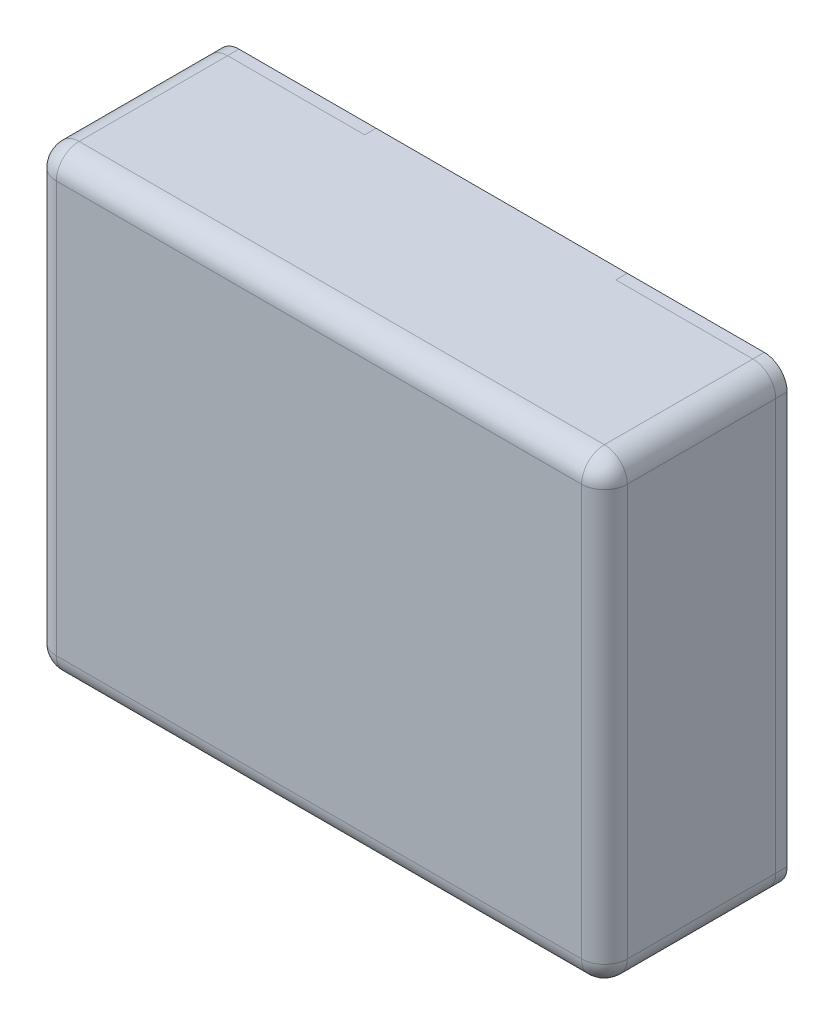
ISO-10303-21;
HEADER;
FILE_DESCRIPTION(('STEP AP214'),'2;1');
FILE_NAME('part.step','',(''),(''),'','','');
FILE_SCHEMA(('AUTOMOTIVE_DESIGN { 1 0 10303 214 1 1 1 1 }'));
ENDSEC;
DATA;
#1=APPLICATION_CONTEXT('core data for automotive mechanical design processes');
#2=APPLICATION_PROTOCOL_DEFINITION('international standard','automotive_design',2000,#1);
#3=PRODUCT_CONTEXT('',#1,'mechanical');
#4=PRODUCT('Part','Part','',(#3));
#5=PRODUCT_RELATED_PRODUCT_CATEGORY('part','',(#4));
#6=PRODUCT_DEFINITION_FORMATION('','',#4);
#7=PRODUCT_DEFINITION_CONTEXT('part definition',#1,'design');
#8=PRODUCT_DEFINITION('design','',#6,#7);
#9=PRODUCT_DEFINITION_SHAPE('','',#8);
#10=(LENGTH_UNIT() NAMED_UNIT(*) SI_UNIT(.MILLI.,.METRE.));
#11=(NAMED_UNIT(*) PLANE_ANGLE_UNIT() SI_UNIT($,.RADIAN.));
#12=(NAMED_UNIT(*) SI_UNIT($,.STERADIAN.) SOLID_ANGLE_UNIT());
#13=UNCERTAINTY_MEASURE_WITH_UNIT(LENGTH_MEASURE(1.E-05),#10,'distance_accuracy_value','');
#14=(GEOMETRIC_REPRESENTATION_CONTEXT(3) GLOBAL_UNCERTAINTY_ASSIGNED_CONTEXT((#13)) GLOBAL_UNIT_ASSIGNED_CONTEXT((#10,
#11,#12)) REPRESENTATION_CONTEXT('',''));
#15=CARTESIAN_POINT('',(0.,0.,0.));
#16=DIRECTION('',(0.,0.,1.));
#17=DIRECTION('',(1.,0.,0.));
#18=AXIS2_PLACEMENT_3D('',#15,#16,#17);
#19=CARTESIAN_POINT('',(1.15,0.9,0.));
#20=DIRECTION('',(0.,0.,1.));
#21=DIRECTION('',(1.,0.,0.));
#22=AXIS2_PLACEMENT_3D('',#19,#20,#21);
#23=CYLINDRICAL_SURFACE('',#22,0.1);
#24=CARTESIAN_POINT('',(1.15,0.9,0.));
#25=DIRECTION('',(0.,0.,1.));
#26=DIRECTION('',(0.,-1.,0.));
#27=AXIS2_PLACEMENT_3D('',#24,#25,#26);
#28=CIRCLE('',#27,0.1);
#29=CARTESIAN_POINT('',(1.25,0.9,0.));
#30=VERTEX_POINT('',#29);
#31=CARTESIAN_POINT('',(1.15,1.,0.));
#32=VERTEX_POINT('',#31);
#33=EDGE_CURVE('E11',#30,#32,#28,.T.);
#34=ORIENTED_EDGE('',*,*,#33,.T.);
#35=DIRECTION('',(0.,0.,1.));
#36=VECTOR('',#35,1.);
#37=CARTESIAN_POINT('',(1.15,1.,0.));
#38=LINE('',#37,#36);
#39=CARTESIAN_POINT('',(1.15,1.,0.05));
#40=VERTEX_POINT('',#39);
#41=EDGE_CURVE('E204',#32,#40,#38,.T.);
#42=ORIENTED_EDGE('',*,*,#41,.T.);
#43=CARTESIAN_POINT('',(1.15,0.9,0.05));
#44=DIRECTION('',(0.,0.,1.));
#45=DIRECTION('',(0.,-1.,0.));
#46=AXIS2_PLACEMENT_3D('',#43,#44,#45);
#47=CIRCLE('',#46,0.1);
#48=CARTESIAN_POINT('',(1.25,0.9,0.05));
#49=VERTEX_POINT('',#48);
#50=EDGE_CURVE('E201',#49,#40,#47,.T.);
#51=ORIENTED_EDGE('',*,*,#50,.F.);
#52=DIRECTION('',(0.,0.,1.));
#53=VECTOR('',#52,1.);
#54=CARTESIAN_POINT('',(1.25,0.9,0.));
#55=LINE('',#54,#53);
#56=EDGE_CURVE('E20',#30,#49,#55,.T.);
#57=ORIENTED_EDGE('',*,*,#56,.F.);
#58=EDGE_LOOP('',(#34,#42,#51,#57));
#59=FACE_BOUND('',#58,.T.);
#60=ADVANCED_FACE('F16',(#59),#23,.T.);
#61=CARTESIAN_POINT('',(0.55,-1.,0.));
#62=DIRECTION('',(0.,0.,1.));
#63=DIRECTION('',(1.,0.,0.));
#64=AXIS2_PLACEMENT_3D('',#61,#62,#63);
#65=PLANE('',#64);
#66=ORIENTED_EDGE('',*,*,#33,.F.);
#67=DIRECTION('',(0.,1.,0.));
#68=VECTOR('',#67,1.);
#69=CARTESIAN_POINT('',(1.25,-1.,0.));
#70=LINE('',#69,#68);
#71=CARTESIAN_POINT('',(1.25,-0.9,0.));
#72=VERTEX_POINT('',#71);
#73=EDGE_CURVE('E197',#72,#30,#70,.T.);
#74=ORIENTED_EDGE('',*,*,#73,.F.);
#75=CARTESIAN_POINT('',(1.15,-0.9,0.));
#76=DIRECTION('',(0.,0.,-1.));
#77=DIRECTION('',(0.,-1.,0.));
#78=AXIS2_PLACEMENT_3D('',#75,#76,#77);
#79=CIRCLE('',#78,0.1);
#80=CARTESIAN_POINT('',(1.15,-1.,0.));
#81=VERTEX_POINT('',#80);
#82=EDGE_CURVE('E27',#72,#81,#79,.T.);
#83=ORIENTED_EDGE('',*,*,#82,.T.);
#84=DIRECTION('',(1.,0.,0.));
#85=VECTOR('',#84,1.);
#86=CARTESIAN_POINT('',(0.55,-1.,0.));
#87=LINE('',#86,#85);
#88=CARTESIAN_POINT('',(0.55,-1.,0.));
#89=VERTEX_POINT('',#88);
#90=EDGE_CURVE('E209',#89,#81,#87,.T.);
#91=ORIENTED_EDGE('',*,*,#90,.F.);
#92=DIRECTION('',(0.,1.,0.));
#93=VECTOR('',#92,1.);
#94=CARTESIAN_POINT('',(0.55,-1.,0.));
#95=LINE('',#94,#93);
#96=CARTESIAN_POINT('',(0.55,1.,0.));
#97=VERTEX_POINT('',#96);
#98=EDGE_CURVE('E272',#89,#97,#95,.T.);
#99=ORIENTED_EDGE('',*,*,#98,.T.);
#100=DIRECTION('',(1.,0.,0.));
#101=VECTOR('',#100,1.);
#102=CARTESIAN_POINT('',(0.55,1.,0.));
#103=LINE('',#102,#101);
#104=EDGE_CURVE('E208',#97,#32,#103,.T.);
#105=ORIENTED_EDGE('',*,*,#104,.T.);
#106=EDGE_LOOP('',(#66,#74,#83,#91,#99,#105));
#107=FACE_BOUND('',#106,.T.);
#108=ADVANCED_FACE('F498',(#107),#65,.F.);
#109=CARTESIAN_POINT('',(1.15,-0.9,0.));
#110=DIRECTION('',(0.,0.,1.));
#111=DIRECTION('',(1.,0.,0.));
#112=AXIS2_PLACEMENT_3D('',#109,#110,#111);
#113=CYLINDRICAL_SURFACE('',#112,0.1);
#114=DIRECTION('',(0.,0.,1.));
#115=VECTOR('',#114,1.);
#116=CARTESIAN_POINT('',(1.25,-0.9,0.));
#117=LINE('',#116,#115);
#118=CARTESIAN_POINT('',(1.25,-0.9,0.05));
#119=VERTEX_POINT('',#118);
#120=EDGE_CURVE('E243',#72,#119,#117,.T.);
#121=ORIENTED_EDGE('',*,*,#120,.T.);
#122=CARTESIAN_POINT('',(1.15,-0.9,0.05));
#123=DIRECTION('',(0.,0.,-1.));
#124=DIRECTION('',(0.,-1.,0.));
#125=AXIS2_PLACEMENT_3D('',#122,#123,#124);
#126=CIRCLE('',#125,0.1);
#127=CARTESIAN_POINT('',(1.15,-1.,0.05));
#128=VERTEX_POINT('',#127);
#129=EDGE_CURVE('E276',#119,#128,#126,.T.);
#130=ORIENTED_EDGE('',*,*,#129,.T.);
#131=DIRECTION('',(0.,0.,1.));
#132=VECTOR('',#131,1.);
#133=CARTESIAN_POINT('',(1.15,-1.,0.));
#134=LINE('',#133,#132);
#135=EDGE_CURVE('E96',#81,#128,#134,.T.);
#136=ORIENTED_EDGE('',*,*,#135,.F.);
#137=ORIENTED_EDGE('',*,*,#82,.F.);
#138=EDGE_LOOP('',(#121,#130,#136,#137));
#139=FACE_BOUND('',#138,.T.);
#140=ADVANCED_FACE('F529',(#139),#113,.T.);
#141=CARTESIAN_POINT('',(1.25,-1.,0.));
#142=DIRECTION('',(1.,0.,0.));
#143=DIRECTION('',(0.,1.,0.));
#144=AXIS2_PLACEMENT_3D('',#141,#142,#143);
#145=PLANE('',#144);
#146=DIRECTION('',(0.,1.,0.));
#147=VECTOR('',#146,1.);
#148=CARTESIAN_POINT('',(1.25,-1.,0.05));
#149=LINE('',#148,#147);
#150=EDGE_CURVE('E195',#119,#49,#149,.T.);
#151=ORIENTED_EDGE('',*,*,#150,.F.);
#152=ORIENTED_EDGE('',*,*,#120,.F.);
#153=ORIENTED_EDGE('',*,*,#73,.T.);
#154=ORIENTED_EDGE('',*,*,#56,.T.);
#155=EDGE_LOOP('',(#151,#152,#153,#154));
#156=FACE_BOUND('',#155,.T.);
#157=ADVANCED_FACE('F192',(#156),#145,.T.);
#158=CARTESIAN_POINT('',(0.55,1.,0.));
#159=DIRECTION('',(0.,1.,0.));
#160=DIRECTION('',(1.,0.,0.));
#161=AXIS2_PLACEMENT_3D('',#158,#159,#160);
#162=PLANE('',#161);
#163=ORIENTED_EDGE('',*,*,#104,.F.);
#164=DIRECTION('',(0.,0.,1.));
#165=VECTOR('',#164,1.);
#166=CARTESIAN_POINT('',(0.55,1.,0.));
#167=LINE('',#166,#165);
#168=CARTESIAN_POINT('',(0.55,1.,0.05));
#169=VERTEX_POINT('',#168);
#170=EDGE_CURVE('E286',#97,#169,#167,.T.);
#171=ORIENTED_EDGE('',*,*,#170,.T.);
#172=DIRECTION('',(1.,0.,0.));
#173=VECTOR('',#172,1.);
#174=CARTESIAN_POINT('',(0.55,1.,0.05));
#175=LINE('',#174,#173);
#176=EDGE_CURVE('E321',#169,#40,#175,.T.);
#177=ORIENTED_EDGE('',*,*,#176,.T.);
#178=ORIENTED_EDGE('',*,*,#41,.F.);
#179=EDGE_LOOP('',(#163,#171,#177,#178));
#180=FACE_BOUND('',#179,.T.);
#181=ADVANCED_FACE('F444',(#180),#162,.T.);
#182=CARTESIAN_POINT('',(1.15,0.9,0.));
#183=DIRECTION('',(0.,0.,1.));
#184=DIRECTION('',(1.,0.,0.));
#185=AXIS2_PLACEMENT_3D('',#182,#183,#184);
#186=CYLINDRICAL_SURFACE('',#185,0.1);
#187=DIRECTION('',(0.,0.,1.));
#188=VECTOR('',#187,1.);
#189=CARTESIAN_POINT('',(1.25,0.9,0.));
#190=LINE('',#189,#188);
#191=CARTESIAN_POINT('',(1.25,0.9,0.7));
#192=VERTEX_POINT('',#191);
#193=EDGE_CURVE('E211',#49,#192,#190,.T.);
#194=ORIENTED_EDGE('',*,*,#193,.F.);
#195=ORIENTED_EDGE('',*,*,#50,.T.);
#196=DIRECTION('',(0.,0.,1.));
#197=VECTOR('',#196,1.);
#198=CARTESIAN_POINT('',(1.15,1.,0.));
#199=LINE('',#198,#197);
#200=CARTESIAN_POINT('',(1.15,1.,0.7));
#201=VERTEX_POINT('',#200);
#202=EDGE_CURVE('E324',#40,#201,#199,.T.);
#203=ORIENTED_EDGE('',*,*,#202,.T.);
#204=CARTESIAN_POINT('',(1.15,0.9,0.7));
#205=DIRECTION('',(0.,0.,-1.));
#206=DIRECTION('',(0.,1.,0.));
#207=AXIS2_PLACEMENT_3D('',#204,#205,#206);
#208=CIRCLE('',#207,0.1);
#209=EDGE_CURVE('E57',#201,#192,#208,.T.);
#210=ORIENTED_EDGE('',*,*,#209,.T.);
#211=EDGE_LOOP('',(#194,#195,#203,#210));
#212=FACE_BOUND('',#211,.T.);
#213=ADVANCED_FACE('F212',(#212),#186,.T.);
#214=CARTESIAN_POINT('',(-1.25,1.,0.));
#215=DIRECTION('',(0.,1.,0.));
#216=DIRECTION('',(1.,0.,0.));
#217=AXIS2_PLACEMENT_3D('',#214,#215,#216);
#218=PLANE('',#217);
#219=DIRECTION('',(1.,0.,0.));
#220=VECTOR('',#219,1.);
#221=CARTESIAN_POINT('',(-1.25,1.,0.));
#222=LINE('',#221,#220);
#223=CARTESIAN_POINT('',(-1.15,1.,0.));
#224=VERTEX_POINT('',#223);
#225=CARTESIAN_POINT('',(-0.55,1.,0.));
#226=VERTEX_POINT('',#225);
#227=EDGE_CURVE('E328',#224,#226,#222,.T.);
#228=ORIENTED_EDGE('',*,*,#227,.F.);
#229=DIRECTION('',(0.,0.,1.));
#230=VECTOR('',#229,1.);
#231=CARTESIAN_POINT('',(-1.15,1.,0.));
#232=LINE('',#231,#230);
#233=CARTESIAN_POINT('',(-1.15,1.,0.05));
#234=VERTEX_POINT('',#233);
#235=EDGE_CURVE('E216',#224,#234,#232,.T.);
#236=ORIENTED_EDGE('',*,*,#235,.T.);
#237=DIRECTION('',(1.,0.,0.));
#238=VECTOR('',#237,1.);
#239=CARTESIAN_POINT('',(-1.25,1.,0.05));
#240=LINE('',#239,#238);
#241=CARTESIAN_POINT('',(-0.55,1.,0.05));
#242=VERTEX_POINT('',#241);
#243=EDGE_CURVE('E319',#234,#242,#240,.T.);
#244=ORIENTED_EDGE('',*,*,#243,.T.);
#245=DIRECTION('',(0.,0.,1.));
#246=VECTOR('',#245,1.);
#247=CARTESIAN_POINT('',(-0.55,1.,0.));
#248=LINE('',#247,#246);
#249=EDGE_CURVE('E285',#226,#242,#248,.T.);
#250=ORIENTED_EDGE('',*,*,#249,.F.);
#251=EDGE_LOOP('',(#228,#236,#244,#250));
#252=FACE_BOUND('',#251,.T.);
#253=ADVANCED_FACE('F506',(#252),#218,.T.);
#254=CARTESIAN_POINT('',(0.55,-1.,0.));
#255=DIRECTION('',(0.,1.,0.));
#256=DIRECTION('',(1.,0.,0.));
#257=AXIS2_PLACEMENT_3D('',#254,#255,#256);
#258=PLANE('',#257);
#259=ORIENTED_EDGE('',*,*,#135,.T.);
#260=DIRECTION('',(1.,0.,0.));
#261=VECTOR('',#260,1.);
#262=CARTESIAN_POINT('',(0.55,-1.,0.05));
#263=LINE('',#262,#261);
#264=CARTESIAN_POINT('',(0.55,-1.,0.05));
#265=VERTEX_POINT('',#264);
#266=EDGE_CURVE('E110',#265,#128,#263,.T.);
#267=ORIENTED_EDGE('',*,*,#266,.F.);
#268=DIRECTION('',(0.,0.,1.));
#269=VECTOR('',#268,1.);
#270=CARTESIAN_POINT('',(0.55,-1.,0.));
#271=LINE('',#270,#269);
#272=EDGE_CURVE('E277',#89,#265,#271,.T.);
#273=ORIENTED_EDGE('',*,*,#272,.F.);
#274=ORIENTED_EDGE('',*,*,#90,.T.);
#275=EDGE_LOOP('',(#259,#267,#273,#274));
#276=FACE_BOUND('',#275,.T.);
#277=ADVANCED_FACE('F544',(#276),#258,.F.);
#278=CARTESIAN_POINT('',(-1.25,-1.,0.));
#279=DIRECTION('',(0.,0.,1.));
#280=DIRECTION('',(1.,0.,0.));
#281=AXIS2_PLACEMENT_3D('',#278,#279,#280);
#282=PLANE('',#281);
#283=DIRECTION('',(1.,0.,0.));
#284=VECTOR('',#283,1.);
#285=CARTESIAN_POINT('',(-1.25,1.,0.));
#286=LINE('',#285,#284);
#287=EDGE_CURVE('E281',#226,#97,#286,.T.);
#288=ORIENTED_EDGE('',*,*,#287,.T.);
#289=ORIENTED_EDGE('',*,*,#98,.F.);
#290=DIRECTION('',(1.,0.,0.));
#291=VECTOR('',#290,1.);
#292=CARTESIAN_POINT('',(-1.25,-1.,0.));
#293=LINE('',#292,#291);
#294=CARTESIAN_POINT('',(-0.55,-1.,0.));
#295=VERTEX_POINT('',#294);
#296=EDGE_CURVE('E279',#295,#89,#293,.T.);
#297=ORIENTED_EDGE('',*,*,#296,.F.);
#298=DIRECTION('',(0.,1.,0.));
#299=VECTOR('',#298,1.);
#300=CARTESIAN_POINT('',(-0.55,-1.,0.));
#301=LINE('',#300,#299);
#302=EDGE_CURVE('E343',#295,#226,#301,.T.);
#303=ORIENTED_EDGE('',*,*,#302,.T.);
#304=EDGE_LOOP('',(#288,#289,#297,#303));
#305=FACE_BOUND('',#304,.T.);
#306=ADVANCED_FACE('F502',(#305),#282,.F.);
#307=CARTESIAN_POINT('',(-1.25,-1.,0.));
#308=DIRECTION('',(0.,1.,0.));
#309=DIRECTION('',(1.,0.,0.));
#310=AXIS2_PLACEMENT_3D('',#307,#308,#309);
#311=PLANE('',#310);
#312=DIRECTION('',(0.,0.,1.));
#313=VECTOR('',#312,1.);
#314=CARTESIAN_POINT('',(-0.55,-1.,0.));
#315=LINE('',#314,#313);
#316=CARTESIAN_POINT('',(-0.55,-1.,0.05));
#317=VERTEX_POINT('',#316);
#318=EDGE_CURVE('E270',#295,#317,#315,.T.);
#319=ORIENTED_EDGE('',*,*,#318,.T.);
#320=DIRECTION('',(1.,0.,0.));
#321=VECTOR('',#320,1.);
#322=CARTESIAN_POINT('',(-1.25,-1.,0.05));
#323=LINE('',#322,#321);
#324=CARTESIAN_POINT('',(-1.15,-1.,0.05));
#325=VERTEX_POINT('',#324);
#326=EDGE_CURVE('E352',#325,#317,#323,.T.);
#327=ORIENTED_EDGE('',*,*,#326,.F.);
#328=DIRECTION('',(0.,0.,1.));
#329=VECTOR('',#328,1.);
#330=CARTESIAN_POINT('',(-1.15,-1.,0.));
#331=LINE('',#330,#329);
#332=CARTESIAN_POINT('',(-1.15,-1.,0.));
#333=VERTEX_POINT('',#332);
#334=EDGE_CURVE('E72',#333,#325,#331,.T.);
#335=ORIENTED_EDGE('',*,*,#334,.F.);
#336=DIRECTION('',(1.,0.,0.));
#337=VECTOR('',#336,1.);
#338=CARTESIAN_POINT('',(-1.25,-1.,0.));
#339=LINE('',#338,#337);
#340=EDGE_CURVE('E312',#333,#295,#339,.T.);
#341=ORIENTED_EDGE('',*,*,#340,.T.);
#342=EDGE_LOOP('',(#319,#327,#335,#341));
#343=FACE_BOUND('',#342,.T.);
#344=ADVANCED_FACE('F534',(#343),#311,.F.);
#345=CARTESIAN_POINT('',(1.15,-0.9,0.));
#346=DIRECTION('',(0.,0.,1.));
#347=DIRECTION('',(1.,0.,0.));
#348=AXIS2_PLACEMENT_3D('',#345,#346,#347);
#349=CYLINDRICAL_SURFACE('',#348,0.1);
#350=CARTESIAN_POINT('',(1.15,-0.9,0.7));
#351=DIRECTION('',(0.,0.,-1.));
#352=DIRECTION('',(1.,0.,0.));
#353=AXIS2_PLACEMENT_3D('',#350,#351,#352);
#354=CIRCLE('',#353,0.1);
#355=CARTESIAN_POINT('',(1.25,-0.9,0.7));
#356=VERTEX_POINT('',#355);
#357=CARTESIAN_POINT('',(1.15,-1.,0.7));
#358=VERTEX_POINT('',#357);
#359=EDGE_CURVE('E266',#356,#358,#354,.T.);
#360=ORIENTED_EDGE('',*,*,#359,.T.);
#361=DIRECTION('',(0.,0.,1.));
#362=VECTOR('',#361,1.);
#363=CARTESIAN_POINT('',(1.15,-1.,0.));
#364=LINE('',#363,#362);
#365=EDGE_CURVE('E289',#128,#358,#364,.T.);
#366=ORIENTED_EDGE('',*,*,#365,.F.);
#367=ORIENTED_EDGE('',*,*,#129,.F.);
#368=DIRECTION('',(0.,0.,1.));
#369=VECTOR('',#368,1.);
#370=CARTESIAN_POINT('',(1.25,-0.9,0.));
#371=LINE('',#370,#369);
#372=EDGE_CURVE('E219',#119,#356,#371,.T.);
#373=ORIENTED_EDGE('',*,*,#372,.T.);
#374=EDGE_LOOP('',(#360,#366,#367,#373));
#375=FACE_BOUND('',#374,.T.);
#376=ADVANCED_FACE('F536',(#375),#349,.T.);
#377=CARTESIAN_POINT('',(-1.25,-1.,0.));
#378=DIRECTION('',(0.,0.,1.));
#379=DIRECTION('',(1.,0.,0.));
#380=AXIS2_PLACEMENT_3D('',#377,#378,#379);
#381=PLANE('',#380);
#382=CARTESIAN_POINT('',(-1.15,0.9,0.));
#383=DIRECTION('',(0.,0.,-1.));
#384=DIRECTION('',(0.,-1.,0.));
#385=AXIS2_PLACEMENT_3D('',#382,#383,#384);
#386=CIRCLE('',#385,0.1);
#387=CARTESIAN_POINT('',(-1.25,0.9,0.));
#388=VERTEX_POINT('',#387);
#389=EDGE_CURVE('E292',#388,#224,#386,.T.);
#390=ORIENTED_EDGE('',*,*,#389,.T.);
#391=ORIENTED_EDGE('',*,*,#227,.T.);
#392=ORIENTED_EDGE('',*,*,#302,.F.);
#393=ORIENTED_EDGE('',*,*,#340,.F.);
#394=CARTESIAN_POINT('',(-1.15,-0.9,0.));
#395=DIRECTION('',(0.,0.,1.));
#396=DIRECTION('',(0.,-1.,0.));
#397=AXIS2_PLACEMENT_3D('',#394,#395,#396);
#398=CIRCLE('',#397,0.1);
#399=CARTESIAN_POINT('',(-1.25,-0.9,0.));
#400=VERTEX_POINT('',#399);
#401=EDGE_CURVE('E320',#400,#333,#398,.T.);
#402=ORIENTED_EDGE('',*,*,#401,.F.);
#403=DIRECTION('',(0.,1.,0.));
#404=VECTOR('',#403,1.);
#405=CARTESIAN_POINT('',(-1.25,-1.,0.));
#406=LINE('',#405,#404);
#407=EDGE_CURVE('E316',#400,#388,#406,.T.);
#408=ORIENTED_EDGE('',*,*,#407,.T.);
#409=EDGE_LOOP('',(#390,#391,#392,#393,#402,#408));
#410=FACE_BOUND('',#409,.T.);
#411=ADVANCED_FACE('F508',(#410),#381,.F.);
#412=CARTESIAN_POINT('',(-1.15,0.9,0.));
#413=DIRECTION('',(0.,0.,1.));
#414=DIRECTION('',(-1.,0.,0.));
#415=AXIS2_PLACEMENT_3D('',#412,#413,#414);
#416=CYLINDRICAL_SURFACE('',#415,0.1);
#417=DIRECTION('',(0.,0.,1.));
#418=VECTOR('',#417,1.);
#419=CARTESIAN_POINT('',(-1.25,0.9,0.));
#420=LINE('',#419,#418);
#421=CARTESIAN_POINT('',(-1.25,0.9,0.05));
#422=VERTEX_POINT('',#421);
#423=EDGE_CURVE('E295',#388,#422,#420,.T.);
#424=ORIENTED_EDGE('',*,*,#423,.T.);
#425=CARTESIAN_POINT('',(-1.15,0.9,0.05));
#426=DIRECTION('',(0.,0.,-1.));
#427=DIRECTION('',(0.,-1.,0.));
#428=AXIS2_PLACEMENT_3D('',#425,#426,#427);
#429=CIRCLE('',#428,0.1);
#430=EDGE_CURVE('E271',#422,#234,#429,.T.);
#431=ORIENTED_EDGE('',*,*,#430,.T.);
#432=ORIENTED_EDGE('',*,*,#235,.F.);
#433=ORIENTED_EDGE('',*,*,#389,.F.);
#434=EDGE_LOOP('',(#424,#431,#432,#433));
#435=FACE_BOUND('',#434,.T.);
#436=ADVANCED_FACE('F422',(#435),#416,.T.);
#437=CARTESIAN_POINT('',(1.25,-1.,0.));
#438=DIRECTION('',(1.,0.,0.));
#439=DIRECTION('',(0.,1.,0.));
#440=AXIS2_PLACEMENT_3D('',#437,#438,#439);
#441=PLANE('',#440);
#442=ORIENTED_EDGE('',*,*,#372,.F.);
#443=ORIENTED_EDGE('',*,*,#150,.T.);
#444=ORIENTED_EDGE('',*,*,#193,.T.);
#445=DIRECTION('',(0.,-1.,0.));
#446=VECTOR('',#445,1.);
#447=CARTESIAN_POINT('',(1.25,0.9,0.7));
#448=LINE('',#447,#446);
#449=EDGE_CURVE('E261',#192,#356,#448,.T.);
#450=ORIENTED_EDGE('',*,*,#449,.T.);
#451=EDGE_LOOP('',(#442,#443,#444,#450));
#452=FACE_BOUND('',#451,.T.);
#453=ADVANCED_FACE('F218',(#452),#441,.T.);
#454=CARTESIAN_POINT('',(1.15,0.9,0.7));
#455=DIRECTION('',(0.,0.,-1.));
#456=DIRECTION('',(0.,1.,0.));
#457=AXIS2_PLACEMENT_3D('',#454,#455,#456);
#458=SPHERICAL_SURFACE('',#457,0.1);
#459=CARTESIAN_POINT('',(1.15,0.9,0.7));
#460=DIRECTION('',(-1.,0.,0.));
#461=DIRECTION('',(0.,0.,1.));
#462=AXIS2_PLACEMENT_3D('',#459,#460,#461);
#463=CIRCLE('',#462,0.1);
#464=CARTESIAN_POINT('',(1.15,0.9,0.8));
#465=VERTEX_POINT('',#464);
#466=EDGE_CURVE('E255',#465,#201,#463,.T.);
#467=ORIENTED_EDGE('',*,*,#466,.F.);
#468=CARTESIAN_POINT('',(1.15,0.9,0.7));
#469=DIRECTION('',(0.,1.,0.));
#470=DIRECTION('',(1.,0.,0.));
#471=AXIS2_PLACEMENT_3D('',#468,#469,#470);
#472=CIRCLE('',#471,0.1);
#473=EDGE_CURVE('E264',#465,#192,#472,.T.);
#474=ORIENTED_EDGE('',*,*,#473,.T.);
#475=ORIENTED_EDGE('',*,*,#209,.F.);
#476=EDGE_LOOP('',(#467,#474,#475));
#477=FACE_BOUND('',#476,.T.);
#478=ADVANCED_FACE('F453',(#477),#458,.T.);
#479=CARTESIAN_POINT('',(-1.25,1.,0.));
#480=DIRECTION('',(0.,1.,0.));
#481=DIRECTION('',(1.,0.,0.));
#482=AXIS2_PLACEMENT_3D('',#479,#480,#481);
#483=PLANE('',#482);
#484=ORIENTED_EDGE('',*,*,#243,.F.);
#485=DIRECTION('',(0.,0.,1.));
#486=VECTOR('',#485,1.);
#487=CARTESIAN_POINT('',(-1.15,1.,0.));
#488=LINE('',#487,#486);
#489=CARTESIAN_POINT('',(-1.15,1.,0.7));
#490=VERTEX_POINT('',#489);
#491=EDGE_CURVE('E299',#234,#490,#488,.T.);
#492=ORIENTED_EDGE('',*,*,#491,.T.);
#493=DIRECTION('',(1.,0.,0.));
#494=VECTOR('',#493,1.);
#495=CARTESIAN_POINT('',(-1.15,1.,0.7));
#496=LINE('',#495,#494);
#497=EDGE_CURVE('E259',#490,#201,#496,.T.);
#498=ORIENTED_EDGE('',*,*,#497,.T.);
#499=ORIENTED_EDGE('',*,*,#202,.F.);
#500=ORIENTED_EDGE('',*,*,#176,.F.);
#501=ORIENTED_EDGE('',*,*,#170,.F.);
#502=ORIENTED_EDGE('',*,*,#287,.F.);
#503=ORIENTED_EDGE('',*,*,#249,.T.);
#504=EDGE_LOOP('',(#484,#492,#498,#499,#500,#501,#502,#503));
#505=FACE_BOUND('',#504,.T.);
#506=ADVANCED_FACE('F447',(#505),#483,.T.);
#507=CARTESIAN_POINT('',(-1.15,-0.9,0.));
#508=DIRECTION('',(0.,0.,1.));
#509=DIRECTION('',(-1.,0.,0.));
#510=AXIS2_PLACEMENT_3D('',#507,#508,#509);
#511=CYLINDRICAL_SURFACE('',#510,0.1);
#512=ORIENTED_EDGE('',*,*,#401,.T.);
#513=ORIENTED_EDGE('',*,*,#334,.T.);
#514=CARTESIAN_POINT('',(-1.15,-0.9,0.05));
#515=DIRECTION('',(0.,0.,1.));
#516=DIRECTION('',(0.,-1.,0.));
#517=AXIS2_PLACEMENT_3D('',#514,#515,#516);
#518=CIRCLE('',#517,0.1);
#519=CARTESIAN_POINT('',(-1.25,-0.9,0.05));
#520=VERTEX_POINT('',#519);
#521=EDGE_CURVE('E229',#520,#325,#518,.T.);
#522=ORIENTED_EDGE('',*,*,#521,.F.);
#523=DIRECTION('',(0.,0.,1.));
#524=VECTOR('',#523,1.);
#525=CARTESIAN_POINT('',(-1.25,-0.9,0.));
#526=LINE('',#525,#524);
#527=EDGE_CURVE('E367',#400,#520,#526,.T.);
#528=ORIENTED_EDGE('',*,*,#527,.F.);
#529=EDGE_LOOP('',(#512,#513,#522,#528));
#530=FACE_BOUND('',#529,.T.);
#531=ADVANCED_FACE('F510',(#530),#511,.T.);
#532=CARTESIAN_POINT('',(-1.25,-1.,0.));
#533=DIRECTION('',(0.,1.,0.));
#534=DIRECTION('',(1.,0.,0.));
#535=AXIS2_PLACEMENT_3D('',#532,#533,#534);
#536=PLANE('',#535);
#537=ORIENTED_EDGE('',*,*,#318,.F.);
#538=ORIENTED_EDGE('',*,*,#296,.T.);
#539=ORIENTED_EDGE('',*,*,#272,.T.);
#540=ORIENTED_EDGE('',*,*,#266,.T.);
#541=ORIENTED_EDGE('',*,*,#365,.T.);
#542=DIRECTION('',(-1.,0.,0.));
#543=VECTOR('',#542,1.);
#544=CARTESIAN_POINT('',(1.15,-1.,0.7));
#545=LINE('',#544,#543);
#546=CARTESIAN_POINT('',(-1.15,-1.,0.7));
#547=VERTEX_POINT('',#546);
#548=EDGE_CURVE('E249',#358,#547,#545,.T.);
#549=ORIENTED_EDGE('',*,*,#548,.T.);
#550=DIRECTION('',(0.,0.,1.));
#551=VECTOR('',#550,1.);
#552=CARTESIAN_POINT('',(-1.15,-1.,0.));
#553=LINE('',#552,#551);
#554=EDGE_CURVE('E260',#325,#547,#553,.T.);
#555=ORIENTED_EDGE('',*,*,#554,.F.);
#556=ORIENTED_EDGE('',*,*,#326,.T.);
#557=EDGE_LOOP('',(#537,#538,#539,#540,#541,#549,#555,#556));
#558=FACE_BOUND('',#557,.T.);
#559=ADVANCED_FACE('F532',(#558),#536,.F.);
#560=CARTESIAN_POINT('',(1.15,-0.9,0.7));
#561=DIRECTION('',(0.,0.,-1.));
#562=DIRECTION('',(1.,0.,0.));
#563=AXIS2_PLACEMENT_3D('',#560,#561,#562);
#564=SPHERICAL_SURFACE('',#563,0.1);
#565=CARTESIAN_POINT('',(1.15,-0.9,0.7));
#566=DIRECTION('',(0.,1.,0.));
#567=DIRECTION('',(0.,0.,1.));
#568=AXIS2_PLACEMENT_3D('',#565,#566,#567);
#569=CIRCLE('',#568,0.1);
#570=CARTESIAN_POINT('',(1.15,-0.9,0.8));
#571=VERTEX_POINT('',#570);
#572=EDGE_CURVE('E265',#571,#356,#569,.T.);
#573=ORIENTED_EDGE('',*,*,#572,.F.);
#574=CARTESIAN_POINT('',(1.15,-0.9,0.7));
#575=DIRECTION('',(1.,0.,0.));
#576=DIRECTION('',(0.,-1.,0.));
#577=AXIS2_PLACEMENT_3D('',#574,#575,#576);
#578=CIRCLE('',#577,0.1);
#579=EDGE_CURVE('E465',#571,#358,#578,.T.);
#580=ORIENTED_EDGE('',*,*,#579,.T.);
#581=ORIENTED_EDGE('',*,*,#359,.F.);
#582=EDGE_LOOP('',(#573,#580,#581));
#583=FACE_BOUND('',#582,.T.);
#584=ADVANCED_FACE('F464',(#583),#564,.T.);
#585=CARTESIAN_POINT('',(-1.15,0.9,0.));
#586=DIRECTION('',(0.,0.,1.));
#587=DIRECTION('',(-1.,0.,0.));
#588=AXIS2_PLACEMENT_3D('',#585,#586,#587);
#589=CYLINDRICAL_SURFACE('',#588,0.1);
#590=CARTESIAN_POINT('',(-1.15,0.9,0.7));
#591=DIRECTION('',(0.,0.,-1.));
#592=DIRECTION('',(-1.,0.,0.));
#593=AXIS2_PLACEMENT_3D('',#590,#591,#592);
#594=CIRCLE('',#593,0.1);
#595=CARTESIAN_POINT('',(-1.25,0.9,0.7));
#596=VERTEX_POINT('',#595);
#597=EDGE_CURVE('E245',#596,#490,#594,.T.);
#598=ORIENTED_EDGE('',*,*,#597,.T.);
#599=ORIENTED_EDGE('',*,*,#491,.F.);
#600=ORIENTED_EDGE('',*,*,#430,.F.);
#601=DIRECTION('',(0.,0.,1.));
#602=VECTOR('',#601,1.);
#603=CARTESIAN_POINT('',(-1.25,0.9,0.));
#604=LINE('',#603,#602);
#605=EDGE_CURVE('E309',#422,#596,#604,.T.);
#606=ORIENTED_EDGE('',*,*,#605,.T.);
#607=EDGE_LOOP('',(#598,#599,#600,#606));
#608=FACE_BOUND('',#607,.T.);
#609=ADVANCED_FACE('F417',(#608),#589,.T.);
#610=CARTESIAN_POINT('',(-1.25,-1.,0.));
#611=DIRECTION('',(1.,0.,0.));
#612=DIRECTION('',(0.,1.,0.));
#613=AXIS2_PLACEMENT_3D('',#610,#611,#612);
#614=PLANE('',#613);
#615=ORIENTED_EDGE('',*,*,#423,.F.);
#616=ORIENTED_EDGE('',*,*,#407,.F.);
#617=ORIENTED_EDGE('',*,*,#527,.T.);
#618=DIRECTION('',(0.,1.,0.));
#619=VECTOR('',#618,1.);
#620=CARTESIAN_POINT('',(-1.25,-1.,0.05));
#621=LINE('',#620,#619);
#622=EDGE_CURVE('E339',#520,#422,#621,.T.);
#623=ORIENTED_EDGE('',*,*,#622,.T.);
#624=EDGE_LOOP('',(#615,#616,#617,#623));
#625=FACE_BOUND('',#624,.T.);
#626=ADVANCED_FACE('F425',(#625),#614,.F.);
#627=CARTESIAN_POINT('',(1.15,0.9,0.7));
#628=DIRECTION('',(0.,-1.,0.));
#629=DIRECTION('',(0.,0.,1.));
#630=AXIS2_PLACEMENT_3D('',#627,#628,#629);
#631=CYLINDRICAL_SURFACE('',#630,0.1);
#632=DIRECTION('',(0.,-1.,0.));
#633=VECTOR('',#632,1.);
#634=CARTESIAN_POINT('',(1.15,0.9,0.8));
#635=LINE('',#634,#633);
#636=EDGE_CURVE('E303',#465,#571,#635,.T.);
#637=ORIENTED_EDGE('',*,*,#636,.T.);
#638=ORIENTED_EDGE('',*,*,#572,.T.);
#639=ORIENTED_EDGE('',*,*,#449,.F.);
#640=ORIENTED_EDGE('',*,*,#473,.F.);
#641=EDGE_LOOP('',(#637,#638,#639,#640));
#642=FACE_BOUND('',#641,.T.);
#643=ADVANCED_FACE('F459',(#642),#631,.T.);
#644=CARTESIAN_POINT('',(-1.15,0.9,0.7));
#645=DIRECTION('',(1.,0.,0.));
#646=DIRECTION('',(0.,0.,1.));
#647=AXIS2_PLACEMENT_3D('',#644,#645,#646);
#648=CYLINDRICAL_SURFACE('',#647,0.1);
#649=DIRECTION('',(1.,0.,0.));
#650=VECTOR('',#649,1.);
#651=CARTESIAN_POINT('',(-1.15,0.9,0.8));
#652=LINE('',#651,#650);
#653=CARTESIAN_POINT('',(-1.15,0.9,0.8));
#654=VERTEX_POINT('',#653);
#655=EDGE_CURVE('E254',#654,#465,#652,.T.);
#656=ORIENTED_EDGE('',*,*,#655,.T.);
#657=ORIENTED_EDGE('',*,*,#466,.T.);
#658=ORIENTED_EDGE('',*,*,#497,.F.);
#659=CARTESIAN_POINT('',(-1.15,0.9,0.7));
#660=DIRECTION('',(-1.,0.,0.));
#661=DIRECTION('',(0.,0.,1.));
#662=AXIS2_PLACEMENT_3D('',#659,#660,#661);
#663=CIRCLE('',#662,0.1);
#664=EDGE_CURVE('E250',#654,#490,#663,.T.);
#665=ORIENTED_EDGE('',*,*,#664,.F.);
#666=EDGE_LOOP('',(#656,#657,#658,#665));
#667=FACE_BOUND('',#666,.T.);
#668=ADVANCED_FACE('F450',(#667),#648,.T.);
#669=CARTESIAN_POINT('',(-1.15,-0.9,0.));
#670=DIRECTION('',(0.,0.,1.));
#671=DIRECTION('',(-1.,0.,0.));
#672=AXIS2_PLACEMENT_3D('',#669,#670,#671);
#673=CYLINDRICAL_SURFACE('',#672,0.1);
#674=DIRECTION('',(0.,0.,1.));
#675=VECTOR('',#674,1.);
#676=CARTESIAN_POINT('',(-1.25,-0.9,0.));
#677=LINE('',#676,#675);
#678=CARTESIAN_POINT('',(-1.25,-0.9,0.7));
#679=VERTEX_POINT('',#678);
#680=EDGE_CURVE('E362',#520,#679,#677,.T.);
#681=ORIENTED_EDGE('',*,*,#680,.F.);
#682=ORIENTED_EDGE('',*,*,#521,.T.);
#683=ORIENTED_EDGE('',*,*,#554,.T.);
#684=CARTESIAN_POINT('',(-1.15,-0.9,0.7));
#685=DIRECTION('',(0.,0.,-1.));
#686=DIRECTION('',(0.,-1.,0.));
#687=AXIS2_PLACEMENT_3D('',#684,#685,#686);
#688=CIRCLE('',#687,0.1);
#689=EDGE_CURVE('E234',#547,#679,#688,.T.);
#690=ORIENTED_EDGE('',*,*,#689,.T.);
#691=EDGE_LOOP('',(#681,#682,#683,#690));
#692=FACE_BOUND('',#691,.T.);
#693=ADVANCED_FACE('F512',(#692),#673,.T.);
#694=CARTESIAN_POINT('',(1.15,-0.9,0.7));
#695=DIRECTION('',(-1.,0.,0.));
#696=DIRECTION('',(0.,0.,1.));
#697=AXIS2_PLACEMENT_3D('',#694,#695,#696);
#698=CYLINDRICAL_SURFACE('',#697,0.1);
#699=DIRECTION('',(-1.,0.,0.));
#700=VECTOR('',#699,1.);
#701=CARTESIAN_POINT('',(1.15,-0.9,0.8));
#702=LINE('',#701,#700);
#703=CARTESIAN_POINT('',(-1.15,-0.9,0.8));
#704=VERTEX_POINT('',#703);
#705=EDGE_CURVE('E300',#571,#704,#702,.T.);
#706=ORIENTED_EDGE('',*,*,#705,.T.);
#707=CARTESIAN_POINT('',(-1.15,-0.9,0.7));
#708=DIRECTION('',(1.,0.,0.));
#709=DIRECTION('',(0.,0.,1.));
#710=AXIS2_PLACEMENT_3D('',#707,#708,#709);
#711=CIRCLE('',#710,0.1);
#712=EDGE_CURVE('E231',#704,#547,#711,.T.);
#713=ORIENTED_EDGE('',*,*,#712,.T.);
#714=ORIENTED_EDGE('',*,*,#548,.F.);
#715=ORIENTED_EDGE('',*,*,#579,.F.);
#716=EDGE_LOOP('',(#706,#713,#714,#715));
#717=FACE_BOUND('',#716,.T.);
#718=ADVANCED_FACE('F468',(#717),#698,.T.);
#719=CARTESIAN_POINT('',(-1.15,0.9,0.7));
#720=DIRECTION('',(0.,0.,-1.));
#721=DIRECTION('',(-1.,0.,0.));
#722=AXIS2_PLACEMENT_3D('',#719,#720,#721);
#723=SPHERICAL_SURFACE('',#722,0.1);
#724=CARTESIAN_POINT('',(-1.15,0.9,0.7));
#725=DIRECTION('',(0.,-1.,0.));
#726=DIRECTION('',(0.,0.,1.));
#727=AXIS2_PLACEMENT_3D('',#724,#725,#726);
#728=CIRCLE('',#727,0.1);
#729=EDGE_CURVE('E236',#654,#596,#728,.T.);
#730=ORIENTED_EDGE('',*,*,#729,.F.);
#731=ORIENTED_EDGE('',*,*,#664,.T.);
#732=ORIENTED_EDGE('',*,*,#597,.F.);
#733=EDGE_LOOP('',(#730,#731,#732));
#734=FACE_BOUND('',#733,.T.);
#735=ADVANCED_FACE('F414',(#734),#723,.T.);
#736=CARTESIAN_POINT('',(-1.25,-1.,0.));
#737=DIRECTION('',(1.,0.,0.));
#738=DIRECTION('',(0.,1.,0.));
#739=AXIS2_PLACEMENT_3D('',#736,#737,#738);
#740=PLANE('',#739);
#741=DIRECTION('',(0.,1.,0.));
#742=VECTOR('',#741,1.);
#743=CARTESIAN_POINT('',(-1.25,-0.9,0.7));
#744=LINE('',#743,#742);
#745=EDGE_CURVE('E240',#679,#596,#744,.T.);
#746=ORIENTED_EDGE('',*,*,#745,.T.);
#747=ORIENTED_EDGE('',*,*,#605,.F.);
#748=ORIENTED_EDGE('',*,*,#622,.F.);
#749=ORIENTED_EDGE('',*,*,#680,.T.);
#750=EDGE_LOOP('',(#746,#747,#748,#749));
#751=FACE_BOUND('',#750,.T.);
#752=ADVANCED_FACE('F405',(#751),#740,.F.);
#753=CARTESIAN_POINT('',(-1.25,-1.,0.8));
#754=DIRECTION('',(0.,0.,1.));
#755=DIRECTION('',(1.,0.,0.));
#756=AXIS2_PLACEMENT_3D('',#753,#754,#755);
#757=PLANE('',#756);
#758=ORIENTED_EDGE('',*,*,#655,.F.);
#759=DIRECTION('',(0.,1.,0.));
#760=VECTOR('',#759,1.);
#761=CARTESIAN_POINT('',(-1.15,-0.9,0.8));
#762=LINE('',#761,#760);
#763=EDGE_CURVE('E241',#704,#654,#762,.T.);
#764=ORIENTED_EDGE('',*,*,#763,.F.);
#765=ORIENTED_EDGE('',*,*,#705,.F.);
#766=ORIENTED_EDGE('',*,*,#636,.F.);
#767=EDGE_LOOP('',(#758,#764,#765,#766));
#768=FACE_BOUND('',#767,.T.);
#769=ADVANCED_FACE('F457',(#768),#757,.T.);
#770=CARTESIAN_POINT('',(-1.15,-0.9,0.7));
#771=DIRECTION('',(0.,0.,-1.));
#772=DIRECTION('',(0.,-1.,0.));
#773=AXIS2_PLACEMENT_3D('',#770,#771,#772);
#774=SPHERICAL_SURFACE('',#773,0.1);
#775=ORIENTED_EDGE('',*,*,#712,.F.);
#776=CARTESIAN_POINT('',(-1.15,-0.9,0.7));
#777=DIRECTION('',(0.,-1.,0.));
#778=DIRECTION('',(-1.,0.,0.));
#779=AXIS2_PLACEMENT_3D('',#776,#777,#778);
#780=CIRCLE('',#779,0.1);
#781=EDGE_CURVE('E235',#704,#679,#780,.T.);
#782=ORIENTED_EDGE('',*,*,#781,.T.);
#783=ORIENTED_EDGE('',*,*,#689,.F.);
#784=EDGE_LOOP('',(#775,#782,#783));
#785=FACE_BOUND('',#784,.T.);
#786=ADVANCED_FACE('F18',(#785),#774,.T.);
#787=CARTESIAN_POINT('',(-1.15,-0.9,0.7));
#788=DIRECTION('',(0.,1.,0.));
#789=DIRECTION('',(0.,0.,1.));
#790=AXIS2_PLACEMENT_3D('',#787,#788,#789);
#791=CYLINDRICAL_SURFACE('',#790,0.1);
#792=ORIENTED_EDGE('',*,*,#763,.T.);
#793=ORIENTED_EDGE('',*,*,#729,.T.);
#794=ORIENTED_EDGE('',*,*,#745,.F.);
#795=ORIENTED_EDGE('',*,*,#781,.F.);
#796=EDGE_LOOP('',(#792,#793,#794,#795));
#797=FACE_BOUND('',#796,.T.);
#798=ADVANCED_FACE('F411',(#797),#791,.T.);
#799=CLOSED_SHELL('',(#60,#108,#140,#157,#181,#213,#253,#277,#306,#344,#376,#411,#436,#453,#478,
#506,#531,#559,#584,#609,#626,#643,#668,#693,#718,#735,#752,#769,#786,#798));
#800=MANIFOLD_SOLID_BREP('B1',#799);
#801=ADVANCED_BREP_SHAPE_REPRESENTATION('',(#18,#800),#14);
#802=SHAPE_DEFINITION_REPRESENTATION(#9,#801);
ENDSEC;
END-ISO-10303-21;
